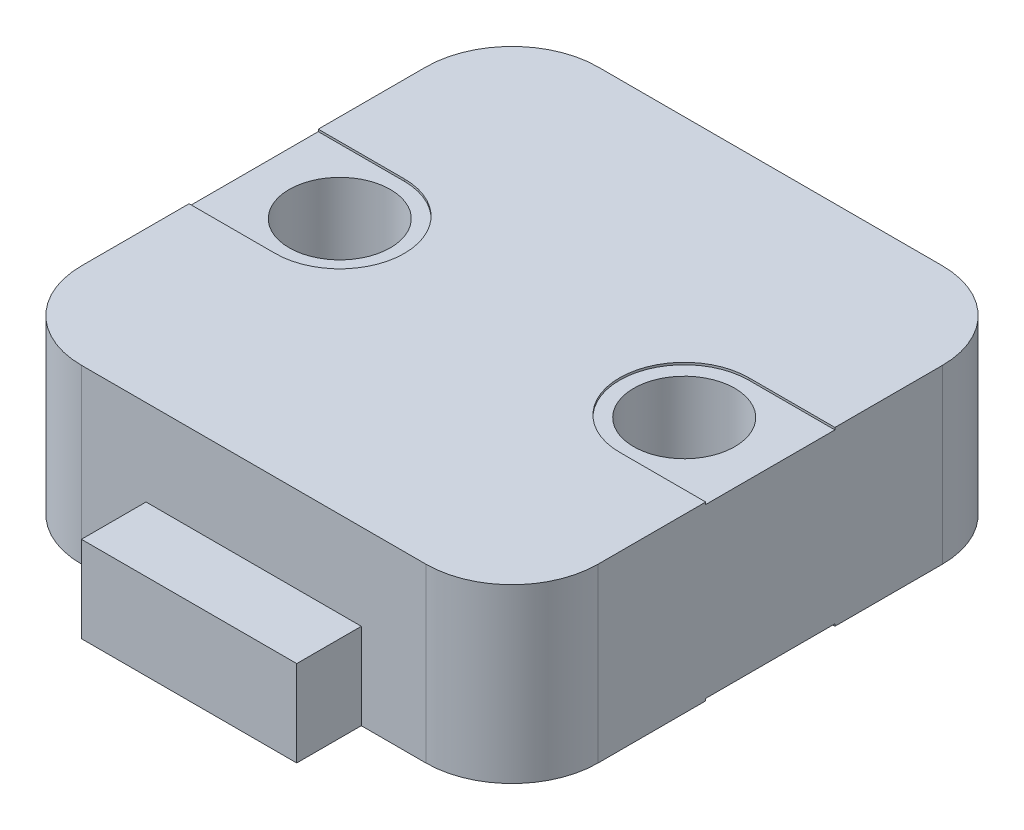
ISO-10303-21;
HEADER;
FILE_DESCRIPTION(('STEP AP214'),'2;1');
FILE_NAME('part.step','',(''),(''),'','','');
FILE_SCHEMA(('AUTOMOTIVE_DESIGN { 1 0 10303 214 1 1 1 1 }'));
ENDSEC;
DATA;
#1=APPLICATION_CONTEXT('core data for automotive mechanical design processes');
#2=APPLICATION_PROTOCOL_DEFINITION('international standard','automotive_design',2000,#1);
#3=PRODUCT_CONTEXT('',#1,'mechanical');
#4=PRODUCT('Part','Part','',(#3));
#5=PRODUCT_RELATED_PRODUCT_CATEGORY('part','',(#4));
#6=PRODUCT_DEFINITION_FORMATION('','',#4);
#7=PRODUCT_DEFINITION_CONTEXT('part definition',#1,'design');
#8=PRODUCT_DEFINITION('design','',#6,#7);
#9=PRODUCT_DEFINITION_SHAPE('','',#8);
#10=(LENGTH_UNIT() NAMED_UNIT(*) SI_UNIT(.MILLI.,.METRE.));
#11=(NAMED_UNIT(*) PLANE_ANGLE_UNIT() SI_UNIT($,.RADIAN.));
#12=(NAMED_UNIT(*) SI_UNIT($,.STERADIAN.) SOLID_ANGLE_UNIT());
#13=UNCERTAINTY_MEASURE_WITH_UNIT(LENGTH_MEASURE(1.E-05),#10,'distance_accuracy_value','');
#14=(GEOMETRIC_REPRESENTATION_CONTEXT(3) GLOBAL_UNCERTAINTY_ASSIGNED_CONTEXT((#13)) GLOBAL_UNIT_ASSIGNED_CONTEXT((#10,
#11,#12)) REPRESENTATION_CONTEXT('',''));
#15=CARTESIAN_POINT('',(0.,0.,0.));
#16=DIRECTION('',(0.,0.,1.));
#17=DIRECTION('',(1.,0.,0.));
#18=AXIS2_PLACEMENT_3D('',#15,#16,#17);
#19=CARTESIAN_POINT('',(-8.,4.,0.));
#20=DIRECTION('',(0.,-1.,0.));
#21=DIRECTION('',(0.,0.,-1.));
#22=AXIS2_PLACEMENT_3D('',#19,#20,#21);
#23=CYLINDRICAL_SURFACE('',#22,2.35);
#24=CARTESIAN_POINT('',(-8.,3.9,0.));
#25=DIRECTION('',(0.,1.,0.));
#26=DIRECTION('',(0.,0.,1.));
#27=AXIS2_PLACEMENT_3D('',#24,#25,#26);
#28=CIRCLE('',#27,2.35);
#29=CARTESIAN_POINT('',(-8.,3.9,2.35));
#30=VERTEX_POINT('',#29);
#31=EDGE_CURVE('E315',#30,#30,#28,.T.);
#32=ORIENTED_EDGE('',*,*,#31,.T.);
#33=EDGE_LOOP('',(#32));
#34=FACE_BOUND('',#33,.T.);
#35=CARTESIAN_POINT('',(-8.,-3.9,0.));
#36=DIRECTION('',(0.,-1.,0.));
#37=DIRECTION('',(0.,0.,-1.));
#38=AXIS2_PLACEMENT_3D('',#35,#36,#37);
#39=CIRCLE('',#38,2.35);
#40=CARTESIAN_POINT('',(-8.,-3.9,-2.35));
#41=VERTEX_POINT('',#40);
#42=EDGE_CURVE('E270',#41,#41,#39,.T.);
#43=ORIENTED_EDGE('',*,*,#42,.T.);
#44=EDGE_LOOP('',(#43));
#45=FACE_BOUND('',#44,.T.);
#46=ADVANCED_FACE('F33',(#34,#45),#23,.F.);
#47=CARTESIAN_POINT('',(-7.99999999999998,-4.,7.99999999999998));
#48=DIRECTION('',(0.,1.,0.));
#49=DIRECTION('',(0.,0.,1.));
#50=AXIS2_PLACEMENT_3D('',#47,#48,#49);
#51=PLANE('',#50);
#52=DIRECTION('',(-1.,0.,0.));
#53=VECTOR('',#52,1.);
#54=CARTESIAN_POINT('',(8.,-4.,-3.));
#55=LINE('',#54,#53);
#56=CARTESIAN_POINT('',(12.,-4.,-3.));
#57=VERTEX_POINT('',#56);
#58=CARTESIAN_POINT('',(8.,-4.,-3.));
#59=VERTEX_POINT('',#58);
#60=EDGE_CURVE('E237',#57,#59,#55,.T.);
#61=ORIENTED_EDGE('',*,*,#60,.T.);
#62=CARTESIAN_POINT('',(8.,-4.,0.));
#63=DIRECTION('',(0.,1.,0.));
#64=DIRECTION('',(0.,0.,-1.));
#65=AXIS2_PLACEMENT_3D('',#62,#63,#64);
#66=CIRCLE('',#65,3.);
#67=CARTESIAN_POINT('',(8.,-4.,3.));
#68=VERTEX_POINT('',#67);
#69=EDGE_CURVE('E240',#59,#68,#66,.T.);
#70=ORIENTED_EDGE('',*,*,#69,.T.);
#71=DIRECTION('',(1.,0.,0.));
#72=VECTOR('',#71,1.);
#73=CARTESIAN_POINT('',(16.5303796260076,-4.,3.));
#74=LINE('',#73,#72);
#75=CARTESIAN_POINT('',(12.,-4.,3.));
#76=VERTEX_POINT('',#75);
#77=EDGE_CURVE('E231',#68,#76,#74,.T.);
#78=ORIENTED_EDGE('',*,*,#77,.T.);
#79=DIRECTION('',(0.,0.,-1.));
#80=VECTOR('',#79,1.);
#81=CARTESIAN_POINT('',(12.,-4.,-8.00000000000001));
#82=LINE('',#81,#80);
#83=CARTESIAN_POINT('',(12.,-4.,7.99999999999995));
#84=VERTEX_POINT('',#83);
#85=EDGE_CURVE('E370',#84,#76,#82,.T.);
#86=ORIENTED_EDGE('',*,*,#85,.F.);
#87=CARTESIAN_POINT('',(8.00000000000002,-4.,7.99999999999998));
#88=DIRECTION('',(0.,1.,0.));
#89=DIRECTION('',(0.,0.,1.));
#90=AXIS2_PLACEMENT_3D('',#87,#88,#89);
#91=CIRCLE('',#90,4.);
#92=CARTESIAN_POINT('',(7.99999999999999,-4.,12.));
#93=VERTEX_POINT('',#92);
#94=EDGE_CURVE('E367',#93,#84,#91,.T.);
#95=ORIENTED_EDGE('',*,*,#94,.F.);
#96=DIRECTION('',(1.,0.,0.));
#97=VECTOR('',#96,1.);
#98=CARTESIAN_POINT('',(-7.99999999999995,-4.,12.));
#99=LINE('',#98,#97);
#100=CARTESIAN_POINT('',(5.,-4.,12.));
#101=VERTEX_POINT('',#100);
#102=EDGE_CURVE('E364',#101,#93,#99,.T.);
#103=ORIENTED_EDGE('',*,*,#102,.F.);
#104=DIRECTION('',(0.,0.,-1.));
#105=VECTOR('',#104,1.);
#106=CARTESIAN_POINT('',(5.,-4.,7.99999999999998));
#107=LINE('',#106,#105);
#108=CARTESIAN_POINT('',(5.,-4.,15.));
#109=VERTEX_POINT('',#108);
#110=EDGE_CURVE('E322',#109,#101,#107,.T.);
#111=ORIENTED_EDGE('',*,*,#110,.F.);
#112=DIRECTION('',(1.,0.,0.));
#113=VECTOR('',#112,1.);
#114=CARTESIAN_POINT('',(-7.99999999999998,-4.,15.));
#115=LINE('',#114,#113);
#116=CARTESIAN_POINT('',(-5.,-4.,15.));
#117=VERTEX_POINT('',#116);
#118=EDGE_CURVE('E329',#117,#109,#115,.T.);
#119=ORIENTED_EDGE('',*,*,#118,.F.);
#120=DIRECTION('',(0.,0.,1.));
#121=VECTOR('',#120,1.);
#122=CARTESIAN_POINT('',(-5.,-4.,7.99999999999998));
#123=LINE('',#122,#121);
#124=CARTESIAN_POINT('',(-5.,-4.,12.));
#125=VERTEX_POINT('',#124);
#126=EDGE_CURVE('E318',#125,#117,#123,.T.);
#127=ORIENTED_EDGE('',*,*,#126,.F.);
#128=CARTESIAN_POINT('',(-7.99999999999995,-4.,12.));
#129=VERTEX_POINT('',#128);
#130=EDGE_CURVE('E365',#129,#125,#99,.T.);
#131=ORIENTED_EDGE('',*,*,#130,.F.);
#132=CARTESIAN_POINT('',(-7.99999999999998,-4.,7.99999999999998));
#133=DIRECTION('',(0.,1.,0.));
#134=DIRECTION('',(0.,0.,1.));
#135=AXIS2_PLACEMENT_3D('',#132,#133,#134);
#136=CIRCLE('',#135,4.);
#137=CARTESIAN_POINT('',(-12.,-4.,7.99999999999995));
#138=VERTEX_POINT('',#137);
#139=EDGE_CURVE('E338',#138,#129,#136,.T.);
#140=ORIENTED_EDGE('',*,*,#139,.F.);
#141=DIRECTION('',(0.,0.,1.));
#142=VECTOR('',#141,1.);
#143=CARTESIAN_POINT('',(-12.,-4.,-8.00000000000001));
#144=LINE('',#143,#142);
#145=CARTESIAN_POINT('',(-12.,-4.,3.));
#146=VERTEX_POINT('',#145);
#147=EDGE_CURVE('E379',#146,#138,#144,.T.);
#148=ORIENTED_EDGE('',*,*,#147,.F.);
#149=DIRECTION('',(1.,0.,0.));
#150=VECTOR('',#149,1.);
#151=CARTESIAN_POINT('',(-16.5303796260076,-4.,3.));
#152=LINE('',#151,#150);
#153=CARTESIAN_POINT('',(-8.,-4.,3.));
#154=VERTEX_POINT('',#153);
#155=EDGE_CURVE('E261',#146,#154,#152,.T.);
#156=ORIENTED_EDGE('',*,*,#155,.T.);
#157=CARTESIAN_POINT('',(-8.,-4.,0.));
#158=DIRECTION('',(0.,1.,0.));
#159=DIRECTION('',(0.,0.,1.));
#160=AXIS2_PLACEMENT_3D('',#157,#158,#159);
#161=CIRCLE('',#160,3.);
#162=CARTESIAN_POINT('',(-8.,-4.,-3.));
#163=VERTEX_POINT('',#162);
#164=EDGE_CURVE('E258',#154,#163,#161,.T.);
#165=ORIENTED_EDGE('',*,*,#164,.T.);
#166=DIRECTION('',(-1.,0.,0.));
#167=VECTOR('',#166,1.);
#168=CARTESIAN_POINT('',(-8.,-4.,-3.));
#169=LINE('',#168,#167);
#170=CARTESIAN_POINT('',(-12.,-4.,-3.));
#171=VERTEX_POINT('',#170);
#172=EDGE_CURVE('E252',#163,#171,#169,.T.);
#173=ORIENTED_EDGE('',*,*,#172,.T.);
#174=CARTESIAN_POINT('',(-12.,-4.,-8.00000000000001));
#175=VERTEX_POINT('',#174);
#176=EDGE_CURVE('E343',#175,#171,#144,.T.);
#177=ORIENTED_EDGE('',*,*,#176,.F.);
#178=CARTESIAN_POINT('',(-7.99999999999998,-4.,-8.00000000000004));
#179=DIRECTION('',(0.,1.,0.));
#180=DIRECTION('',(0.,0.,1.));
#181=AXIS2_PLACEMENT_3D('',#178,#179,#180);
#182=CIRCLE('',#181,4.);
#183=CARTESIAN_POINT('',(-7.99999999999995,-4.,-12.));
#184=VERTEX_POINT('',#183);
#185=EDGE_CURVE('E377',#184,#175,#182,.T.);
#186=ORIENTED_EDGE('',*,*,#185,.F.);
#187=DIRECTION('',(-1.,0.,0.));
#188=VECTOR('',#187,1.);
#189=CARTESIAN_POINT('',(-7.99999999999995,-4.,-12.));
#190=LINE('',#189,#188);
#191=CARTESIAN_POINT('',(7.99999999999999,-4.,-12.));
#192=VERTEX_POINT('',#191);
#193=EDGE_CURVE('E375',#192,#184,#190,.T.);
#194=ORIENTED_EDGE('',*,*,#193,.F.);
#195=CARTESIAN_POINT('',(8.00000000000002,-4.,-8.00000000000004));
#196=DIRECTION('',(0.,1.,0.));
#197=DIRECTION('',(0.,0.,-1.));
#198=AXIS2_PLACEMENT_3D('',#195,#196,#197);
#199=CIRCLE('',#198,4.);
#200=CARTESIAN_POINT('',(12.,-4.,-8.00000000000001));
#201=VERTEX_POINT('',#200);
#202=EDGE_CURVE('E373',#201,#192,#199,.T.);
#203=ORIENTED_EDGE('',*,*,#202,.F.);
#204=EDGE_CURVE('E369',#57,#201,#82,.T.);
#205=ORIENTED_EDGE('',*,*,#204,.F.);
#206=EDGE_LOOP('',(#61,#70,#78,#86,#95,#103,#111,#119,#127,#131,#140,#148,#156,#165,#173,#177,
#186,#194,#203,#205));
#207=FACE_BOUND('',#206,.T.);
#208=ADVANCED_FACE('F439',(#207),#51,.F.);
#209=CARTESIAN_POINT('',(12.,4.,-8.00000000000001));
#210=DIRECTION('',(-1.,0.,0.));
#211=DIRECTION('',(0.,0.,1.));
#212=AXIS2_PLACEMENT_3D('',#209,#210,#211);
#213=PLANE('',#212);
#214=DIRECTION('',(0.,1.,0.));
#215=VECTOR('',#214,1.);
#216=CARTESIAN_POINT('',(12.,4.,-3.));
#217=LINE('',#216,#215);
#218=CARTESIAN_POINT('',(12.,-3.9,-3.));
#219=VERTEX_POINT('',#218);
#220=EDGE_CURVE('E11',#57,#219,#217,.T.);
#221=ORIENTED_EDGE('',*,*,#220,.F.);
#222=ORIENTED_EDGE('',*,*,#204,.T.);
#223=DIRECTION('',(0.,-1.,0.));
#224=VECTOR('',#223,1.);
#225=CARTESIAN_POINT('',(12.,4.,-8.00000000000001));
#226=LINE('',#225,#224);
#227=CARTESIAN_POINT('',(12.,4.,-8.00000000000001));
#228=VERTEX_POINT('',#227);
#229=EDGE_CURVE('E393',#228,#201,#226,.T.);
#230=ORIENTED_EDGE('',*,*,#229,.F.);
#231=DIRECTION('',(0.,0.,-1.));
#232=VECTOR('',#231,1.);
#233=CARTESIAN_POINT('',(12.,4.,-8.00000000000001));
#234=LINE('',#233,#232);
#235=CARTESIAN_POINT('',(12.,4.,-3.));
#236=VERTEX_POINT('',#235);
#237=EDGE_CURVE('E347',#236,#228,#234,.T.);
#238=ORIENTED_EDGE('',*,*,#237,.F.);
#239=DIRECTION('',(0.,-1.,0.));
#240=VECTOR('',#239,1.);
#241=CARTESIAN_POINT('',(12.,4.,-3.));
#242=LINE('',#241,#240);
#243=CARTESIAN_POINT('',(12.,3.9,-3.));
#244=VERTEX_POINT('',#243);
#245=EDGE_CURVE('E423',#236,#244,#242,.T.);
#246=ORIENTED_EDGE('',*,*,#245,.T.);
#247=DIRECTION('',(0.,0.,1.));
#248=VECTOR('',#247,1.);
#249=CARTESIAN_POINT('',(12.,3.9,-8.00000000000001));
#250=LINE('',#249,#248);
#251=CARTESIAN_POINT('',(12.,3.9,3.));
#252=VERTEX_POINT('',#251);
#253=EDGE_CURVE('E312',#244,#252,#250,.T.);
#254=ORIENTED_EDGE('',*,*,#253,.T.);
#255=DIRECTION('',(0.,1.,0.));
#256=VECTOR('',#255,1.);
#257=CARTESIAN_POINT('',(12.,4.,3.));
#258=LINE('',#257,#256);
#259=CARTESIAN_POINT('',(12.,4.,3.));
#260=VERTEX_POINT('',#259);
#261=EDGE_CURVE('E426',#252,#260,#258,.T.);
#262=ORIENTED_EDGE('',*,*,#261,.T.);
#263=CARTESIAN_POINT('',(12.,4.,7.99999999999995));
#264=VERTEX_POINT('',#263);
#265=EDGE_CURVE('E348',#264,#260,#234,.T.);
#266=ORIENTED_EDGE('',*,*,#265,.F.);
#267=DIRECTION('',(0.,-1.,0.));
#268=VECTOR('',#267,1.);
#269=CARTESIAN_POINT('',(12.,4.,7.99999999999995));
#270=LINE('',#269,#268);
#271=EDGE_CURVE('E396',#264,#84,#270,.T.);
#272=ORIENTED_EDGE('',*,*,#271,.T.);
#273=ORIENTED_EDGE('',*,*,#85,.T.);
#274=DIRECTION('',(0.,-1.,0.));
#275=VECTOR('',#274,1.);
#276=CARTESIAN_POINT('',(12.,4.,3.));
#277=LINE('',#276,#275);
#278=CARTESIAN_POINT('',(12.,-3.9,3.));
#279=VERTEX_POINT('',#278);
#280=EDGE_CURVE('E41',#279,#76,#277,.T.);
#281=ORIENTED_EDGE('',*,*,#280,.F.);
#282=DIRECTION('',(0.,0.,-1.));
#283=VECTOR('',#282,1.);
#284=CARTESIAN_POINT('',(12.,-3.9,-8.00000000000001));
#285=LINE('',#284,#283);
#286=EDGE_CURVE('E236',#279,#219,#285,.T.);
#287=ORIENTED_EDGE('',*,*,#286,.T.);
#288=EDGE_LOOP('',(#221,#222,#230,#238,#246,#254,#262,#266,#272,#273,#281,#287));
#289=FACE_BOUND('',#288,.T.);
#290=ADVANCED_FACE('F442',(#289),#213,.F.);
#291=CARTESIAN_POINT('',(-12.,4.,-8.00000000000001));
#292=DIRECTION('',(1.,0.,0.));
#293=DIRECTION('',(0.,0.,-1.));
#294=AXIS2_PLACEMENT_3D('',#291,#292,#293);
#295=PLANE('',#294);
#296=DIRECTION('',(0.,-1.,0.));
#297=VECTOR('',#296,1.);
#298=CARTESIAN_POINT('',(-12.,4.,-3.));
#299=LINE('',#298,#297);
#300=CARTESIAN_POINT('',(-12.,-3.9,-3.));
#301=VERTEX_POINT('',#300);
#302=EDGE_CURVE('E435',#301,#171,#299,.T.);
#303=ORIENTED_EDGE('',*,*,#302,.F.);
#304=DIRECTION('',(0.,0.,-1.));
#305=VECTOR('',#304,1.);
#306=CARTESIAN_POINT('',(-12.,-3.9,-8.00000000000001));
#307=LINE('',#306,#305);
#308=CARTESIAN_POINT('',(-12.,-3.9,3.));
#309=VERTEX_POINT('',#308);
#310=EDGE_CURVE('E429',#309,#301,#307,.T.);
#311=ORIENTED_EDGE('',*,*,#310,.F.);
#312=DIRECTION('',(0.,1.,0.));
#313=VECTOR('',#312,1.);
#314=CARTESIAN_POINT('',(-12.,4.,3.));
#315=LINE('',#314,#313);
#316=EDGE_CURVE('E433',#146,#309,#315,.T.);
#317=ORIENTED_EDGE('',*,*,#316,.F.);
#318=ORIENTED_EDGE('',*,*,#147,.T.);
#319=DIRECTION('',(0.,-1.,0.));
#320=VECTOR('',#319,1.);
#321=CARTESIAN_POINT('',(-12.,4.,7.99999999999995));
#322=LINE('',#321,#320);
#323=CARTESIAN_POINT('',(-12.,4.,7.99999999999995));
#324=VERTEX_POINT('',#323);
#325=EDGE_CURVE('E361',#324,#138,#322,.T.);
#326=ORIENTED_EDGE('',*,*,#325,.F.);
#327=DIRECTION('',(0.,0.,1.));
#328=VECTOR('',#327,1.);
#329=CARTESIAN_POINT('',(-12.,4.,-8.00000000000001));
#330=LINE('',#329,#328);
#331=CARTESIAN_POINT('',(-12.,4.,3.));
#332=VERTEX_POINT('',#331);
#333=EDGE_CURVE('E357',#332,#324,#330,.T.);
#334=ORIENTED_EDGE('',*,*,#333,.F.);
#335=DIRECTION('',(0.,-1.,0.));
#336=VECTOR('',#335,1.);
#337=CARTESIAN_POINT('',(-12.,4.,3.));
#338=LINE('',#337,#336);
#339=CARTESIAN_POINT('',(-12.,3.9,3.));
#340=VERTEX_POINT('',#339);
#341=EDGE_CURVE('E420',#332,#340,#338,.T.);
#342=ORIENTED_EDGE('',*,*,#341,.T.);
#343=DIRECTION('',(0.,0.,1.));
#344=VECTOR('',#343,1.);
#345=CARTESIAN_POINT('',(-12.,3.9,-8.00000000000001));
#346=LINE('',#345,#344);
#347=CARTESIAN_POINT('',(-12.,3.9,-3.));
#348=VERTEX_POINT('',#347);
#349=EDGE_CURVE('E316',#348,#340,#346,.T.);
#350=ORIENTED_EDGE('',*,*,#349,.F.);
#351=DIRECTION('',(0.,1.,0.));
#352=VECTOR('',#351,1.);
#353=CARTESIAN_POINT('',(-12.,4.,-3.));
#354=LINE('',#353,#352);
#355=CARTESIAN_POINT('',(-12.,4.,-3.));
#356=VERTEX_POINT('',#355);
#357=EDGE_CURVE('E413',#348,#356,#354,.T.);
#358=ORIENTED_EDGE('',*,*,#357,.T.);
#359=CARTESIAN_POINT('',(-12.,4.,-8.00000000000001));
#360=VERTEX_POINT('',#359);
#361=EDGE_CURVE('E358',#360,#356,#330,.T.);
#362=ORIENTED_EDGE('',*,*,#361,.F.);
#363=DIRECTION('',(0.,-1.,0.));
#364=VECTOR('',#363,1.);
#365=CARTESIAN_POINT('',(-12.,4.,-8.00000000000001));
#366=LINE('',#365,#364);
#367=EDGE_CURVE('E384',#360,#175,#366,.T.);
#368=ORIENTED_EDGE('',*,*,#367,.T.);
#369=ORIENTED_EDGE('',*,*,#176,.T.);
#370=EDGE_LOOP('',(#303,#311,#317,#318,#326,#334,#342,#350,#358,#362,#368,#369));
#371=FACE_BOUND('',#370,.T.);
#372=ADVANCED_FACE('F496',(#371),#295,.F.);
#373=CARTESIAN_POINT('',(-7.99999999999995,4.,12.));
#374=DIRECTION('',(0.,0.,-1.));
#375=DIRECTION('',(-1.,0.,0.));
#376=AXIS2_PLACEMENT_3D('',#373,#374,#375);
#377=PLANE('',#376);
#378=DIRECTION('',(0.,-1.,0.));
#379=VECTOR('',#378,1.);
#380=CARTESIAN_POINT('',(-5.,4.,12.));
#381=LINE('',#380,#379);
#382=CARTESIAN_POINT('',(-5.,0.,12.));
#383=VERTEX_POINT('',#382);
#384=EDGE_CURVE('E410',#383,#125,#381,.T.);
#385=ORIENTED_EDGE('',*,*,#384,.F.);
#386=DIRECTION('',(1.,0.,0.));
#387=VECTOR('',#386,1.);
#388=CARTESIAN_POINT('',(-7.99999999999995,0.,12.));
#389=LINE('',#388,#387);
#390=CARTESIAN_POINT('',(5.,0.,12.));
#391=VERTEX_POINT('',#390);
#392=EDGE_CURVE('E405',#383,#391,#389,.T.);
#393=ORIENTED_EDGE('',*,*,#392,.T.);
#394=DIRECTION('',(0.,1.,0.));
#395=VECTOR('',#394,1.);
#396=CARTESIAN_POINT('',(5.,4.,12.));
#397=LINE('',#396,#395);
#398=EDGE_CURVE('E407',#101,#391,#397,.T.);
#399=ORIENTED_EDGE('',*,*,#398,.F.);
#400=ORIENTED_EDGE('',*,*,#102,.T.);
#401=DIRECTION('',(0.,-1.,0.));
#402=VECTOR('',#401,1.);
#403=CARTESIAN_POINT('',(7.99999999999999,4.,12.));
#404=LINE('',#403,#402);
#405=CARTESIAN_POINT('',(7.99999999999999,4.,12.));
#406=VERTEX_POINT('',#405);
#407=EDGE_CURVE('E399',#406,#93,#404,.T.);
#408=ORIENTED_EDGE('',*,*,#407,.F.);
#409=DIRECTION('',(1.,0.,0.));
#410=VECTOR('',#409,1.);
#411=CARTESIAN_POINT('',(-7.99999999999995,4.,12.));
#412=LINE('',#411,#410);
#413=CARTESIAN_POINT('',(-7.99999999999995,4.,12.));
#414=VERTEX_POINT('',#413);
#415=EDGE_CURVE('E342',#414,#406,#412,.T.);
#416=ORIENTED_EDGE('',*,*,#415,.F.);
#417=DIRECTION('',(0.,-1.,0.));
#418=VECTOR('',#417,1.);
#419=CARTESIAN_POINT('',(-7.99999999999995,4.,12.));
#420=LINE('',#419,#418);
#421=EDGE_CURVE('E402',#414,#129,#420,.T.);
#422=ORIENTED_EDGE('',*,*,#421,.T.);
#423=ORIENTED_EDGE('',*,*,#130,.T.);
#424=EDGE_LOOP('',(#385,#393,#399,#400,#408,#416,#422,#423));
#425=FACE_BOUND('',#424,.T.);
#426=ADVANCED_FACE('F453',(#425),#377,.F.);
#427=CARTESIAN_POINT('',(-7.99999999999998,4.,7.99999999999998));
#428=DIRECTION('',(0.,1.,0.));
#429=DIRECTION('',(0.,0.,1.));
#430=AXIS2_PLACEMENT_3D('',#427,#428,#429);
#431=PLANE('',#430);
#432=DIRECTION('',(1.,0.,0.));
#433=VECTOR('',#432,1.);
#434=CARTESIAN_POINT('',(16.5303796260076,4.,3.));
#435=LINE('',#434,#433);
#436=CARTESIAN_POINT('',(8.,4.,3.));
#437=VERTEX_POINT('',#436);
#438=EDGE_CURVE('E277',#437,#260,#435,.T.);
#439=ORIENTED_EDGE('',*,*,#438,.F.);
#440=CARTESIAN_POINT('',(8.,4.,0.));
#441=DIRECTION('',(0.,1.,0.));
#442=DIRECTION('',(0.,0.,-1.));
#443=AXIS2_PLACEMENT_3D('',#440,#441,#442);
#444=CIRCLE('',#443,3.);
#445=CARTESIAN_POINT('',(8.,4.,-3.));
#446=VERTEX_POINT('',#445);
#447=EDGE_CURVE('E285',#446,#437,#444,.T.);
#448=ORIENTED_EDGE('',*,*,#447,.F.);
#449=DIRECTION('',(-1.,0.,0.));
#450=VECTOR('',#449,1.);
#451=CARTESIAN_POINT('',(8.,4.,-3.));
#452=LINE('',#451,#450);
#453=EDGE_CURVE('E283',#236,#446,#452,.T.);
#454=ORIENTED_EDGE('',*,*,#453,.F.);
#455=ORIENTED_EDGE('',*,*,#237,.T.);
#456=CARTESIAN_POINT('',(8.00000000000002,4.,-8.00000000000004));
#457=DIRECTION('',(0.,1.,0.));
#458=DIRECTION('',(0.,0.,-1.));
#459=AXIS2_PLACEMENT_3D('',#456,#457,#458);
#460=CIRCLE('',#459,4.);
#461=CARTESIAN_POINT('',(7.99999999999999,4.,-12.));
#462=VERTEX_POINT('',#461);
#463=EDGE_CURVE('E351',#228,#462,#460,.T.);
#464=ORIENTED_EDGE('',*,*,#463,.T.);
#465=DIRECTION('',(-1.,0.,0.));
#466=VECTOR('',#465,1.);
#467=CARTESIAN_POINT('',(-7.99999999999995,4.,-12.));
#468=LINE('',#467,#466);
#469=CARTESIAN_POINT('',(-7.99999999999995,4.,-12.));
#470=VERTEX_POINT('',#469);
#471=EDGE_CURVE('E353',#462,#470,#468,.T.);
#472=ORIENTED_EDGE('',*,*,#471,.T.);
#473=CARTESIAN_POINT('',(-7.99999999999998,4.,-8.00000000000004));
#474=DIRECTION('',(0.,1.,0.));
#475=DIRECTION('',(0.,0.,1.));
#476=AXIS2_PLACEMENT_3D('',#473,#474,#475);
#477=CIRCLE('',#476,4.);
#478=EDGE_CURVE('E355',#470,#360,#477,.T.);
#479=ORIENTED_EDGE('',*,*,#478,.T.);
#480=ORIENTED_EDGE('',*,*,#361,.T.);
#481=DIRECTION('',(-1.,0.,0.));
#482=VECTOR('',#481,1.);
#483=CARTESIAN_POINT('',(-8.,4.,-3.));
#484=LINE('',#483,#482);
#485=CARTESIAN_POINT('',(-8.,4.,-3.));
#486=VERTEX_POINT('',#485);
#487=EDGE_CURVE('E306',#486,#356,#484,.T.);
#488=ORIENTED_EDGE('',*,*,#487,.F.);
#489=CARTESIAN_POINT('',(-8.,4.,0.));
#490=DIRECTION('',(0.,1.,0.));
#491=DIRECTION('',(0.,0.,1.));
#492=AXIS2_PLACEMENT_3D('',#489,#490,#491);
#493=CIRCLE('',#492,3.);
#494=CARTESIAN_POINT('',(-8.,4.,3.));
#495=VERTEX_POINT('',#494);
#496=EDGE_CURVE('E273',#495,#486,#493,.T.);
#497=ORIENTED_EDGE('',*,*,#496,.F.);
#498=DIRECTION('',(1.,0.,0.));
#499=VECTOR('',#498,1.);
#500=CARTESIAN_POINT('',(-16.5303796260076,4.,3.));
#501=LINE('',#500,#499);
#502=EDGE_CURVE('E299',#332,#495,#501,.T.);
#503=ORIENTED_EDGE('',*,*,#502,.F.);
#504=ORIENTED_EDGE('',*,*,#333,.T.);
#505=CARTESIAN_POINT('',(-7.99999999999998,4.,7.99999999999998));
#506=DIRECTION('',(0.,1.,0.));
#507=DIRECTION('',(0.,0.,1.));
#508=AXIS2_PLACEMENT_3D('',#505,#506,#507);
#509=CIRCLE('',#508,4.);
#510=EDGE_CURVE('E339',#324,#414,#509,.T.);
#511=ORIENTED_EDGE('',*,*,#510,.T.);
#512=ORIENTED_EDGE('',*,*,#415,.T.);
#513=CARTESIAN_POINT('',(8.00000000000002,4.,7.99999999999998));
#514=DIRECTION('',(0.,1.,0.));
#515=DIRECTION('',(0.,0.,1.));
#516=AXIS2_PLACEMENT_3D('',#513,#514,#515);
#517=CIRCLE('',#516,4.);
#518=EDGE_CURVE('E345',#406,#264,#517,.T.);
#519=ORIENTED_EDGE('',*,*,#518,.T.);
#520=ORIENTED_EDGE('',*,*,#265,.T.);
#521=EDGE_LOOP('',(#439,#448,#454,#455,#464,#472,#479,#480,#488,#497,#503,#504,#511,#512,#519,#520));
#522=FACE_BOUND('',#521,.T.);
#523=ADVANCED_FACE('F492',(#522),#431,.T.);
#524=CARTESIAN_POINT('',(-7.99999999999998,4.,7.99999999999998));
#525=DIRECTION('',(0.,-1.,0.));
#526=DIRECTION('',(0.,0.,-1.));
#527=AXIS2_PLACEMENT_3D('',#524,#525,#526);
#528=CYLINDRICAL_SURFACE('',#527,4.);
#529=ORIENTED_EDGE('',*,*,#139,.T.);
#530=ORIENTED_EDGE('',*,*,#421,.F.);
#531=ORIENTED_EDGE('',*,*,#510,.F.);
#532=ORIENTED_EDGE('',*,*,#325,.T.);
#533=EDGE_LOOP('',(#529,#530,#531,#532));
#534=FACE_BOUND('',#533,.T.);
#535=ADVANCED_FACE('F35',(#534),#528,.T.);
#536=CARTESIAN_POINT('',(8.00000000000002,4.,7.99999999999998));
#537=DIRECTION('',(0.,-1.,0.));
#538=DIRECTION('',(0.,0.,-1.));
#539=AXIS2_PLACEMENT_3D('',#536,#537,#538);
#540=CYLINDRICAL_SURFACE('',#539,4.);
#541=ORIENTED_EDGE('',*,*,#94,.T.);
#542=ORIENTED_EDGE('',*,*,#271,.F.);
#543=ORIENTED_EDGE('',*,*,#518,.F.);
#544=ORIENTED_EDGE('',*,*,#407,.T.);
#545=EDGE_LOOP('',(#541,#542,#543,#544));
#546=FACE_BOUND('',#545,.T.);
#547=ADVANCED_FACE('F447',(#546),#540,.T.);
#548=CARTESIAN_POINT('',(8.00000000000002,4.,-8.00000000000004));
#549=DIRECTION('',(0.,-1.,0.));
#550=DIRECTION('',(0.,0.,-1.));
#551=AXIS2_PLACEMENT_3D('',#548,#549,#550);
#552=CYLINDRICAL_SURFACE('',#551,4.);
#553=ORIENTED_EDGE('',*,*,#202,.T.);
#554=DIRECTION('',(0.,-1.,0.));
#555=VECTOR('',#554,1.);
#556=CARTESIAN_POINT('',(7.99999999999999,4.,-12.));
#557=LINE('',#556,#555);
#558=EDGE_CURVE('E390',#462,#192,#557,.T.);
#559=ORIENTED_EDGE('',*,*,#558,.F.);
#560=ORIENTED_EDGE('',*,*,#463,.F.);
#561=ORIENTED_EDGE('',*,*,#229,.T.);
#562=EDGE_LOOP('',(#553,#559,#560,#561));
#563=FACE_BOUND('',#562,.T.);
#564=ADVANCED_FACE('F507',(#563),#552,.T.);
#565=CARTESIAN_POINT('',(-7.99999999999995,4.,-12.));
#566=DIRECTION('',(0.,0.,1.));
#567=DIRECTION('',(1.,0.,0.));
#568=AXIS2_PLACEMENT_3D('',#565,#566,#567);
#569=PLANE('',#568);
#570=ORIENTED_EDGE('',*,*,#193,.T.);
#571=DIRECTION('',(0.,-1.,0.));
#572=VECTOR('',#571,1.);
#573=CARTESIAN_POINT('',(-7.99999999999995,4.,-12.));
#574=LINE('',#573,#572);
#575=EDGE_CURVE('E387',#470,#184,#574,.T.);
#576=ORIENTED_EDGE('',*,*,#575,.F.);
#577=ORIENTED_EDGE('',*,*,#471,.F.);
#578=ORIENTED_EDGE('',*,*,#558,.T.);
#579=EDGE_LOOP('',(#570,#576,#577,#578));
#580=FACE_BOUND('',#579,.T.);
#581=ADVANCED_FACE('F503',(#580),#569,.F.);
#582=CARTESIAN_POINT('',(-7.99999999999998,4.,-8.00000000000004));
#583=DIRECTION('',(0.,-1.,0.));
#584=DIRECTION('',(0.,0.,-1.));
#585=AXIS2_PLACEMENT_3D('',#582,#583,#584);
#586=CYLINDRICAL_SURFACE('',#585,4.);
#587=ORIENTED_EDGE('',*,*,#185,.T.);
#588=ORIENTED_EDGE('',*,*,#367,.F.);
#589=ORIENTED_EDGE('',*,*,#478,.F.);
#590=ORIENTED_EDGE('',*,*,#575,.T.);
#591=EDGE_LOOP('',(#587,#588,#589,#590));
#592=FACE_BOUND('',#591,.T.);
#593=ADVANCED_FACE('F500',(#592),#586,.T.);
#594=CARTESIAN_POINT('',(8.,4.,0.));
#595=DIRECTION('',(0.,-1.,0.));
#596=DIRECTION('',(0.,0.,-1.));
#597=AXIS2_PLACEMENT_3D('',#594,#595,#596);
#598=CYLINDRICAL_SURFACE('',#597,2.35);
#599=CARTESIAN_POINT('',(8.,-3.9,0.));
#600=DIRECTION('',(0.,1.,0.));
#601=DIRECTION('',(0.,0.,1.));
#602=AXIS2_PLACEMENT_3D('',#599,#600,#601);
#603=CIRCLE('',#602,2.35);
#604=CARTESIAN_POINT('',(8.,-3.9,2.35));
#605=VERTEX_POINT('',#604);
#606=EDGE_CURVE('E247',#605,#605,#603,.T.);
#607=ORIENTED_EDGE('',*,*,#606,.F.);
#608=EDGE_LOOP('',(#607));
#609=FACE_BOUND('',#608,.T.);
#610=CARTESIAN_POINT('',(8.,3.9,0.));
#611=DIRECTION('',(0.,-1.,0.));
#612=DIRECTION('',(0.,0.,-1.));
#613=AXIS2_PLACEMENT_3D('',#610,#611,#612);
#614=CIRCLE('',#613,2.35);
#615=CARTESIAN_POINT('',(8.,3.9,-2.35));
#616=VERTEX_POINT('',#615);
#617=EDGE_CURVE('E292',#616,#616,#614,.T.);
#618=ORIENTED_EDGE('',*,*,#617,.F.);
#619=EDGE_LOOP('',(#618));
#620=FACE_BOUND('',#619,.T.);
#621=ADVANCED_FACE('F490',(#609,#620),#598,.F.);
#622=CARTESIAN_POINT('',(-5.,0.,7.99999999999998));
#623=DIRECTION('',(1.,0.,0.));
#624=DIRECTION('',(0.,0.,-1.));
#625=AXIS2_PLACEMENT_3D('',#622,#623,#624);
#626=PLANE('',#625);
#627=DIRECTION('',(0.,0.,1.));
#628=VECTOR('',#627,1.);
#629=CARTESIAN_POINT('',(-5.,0.,7.99999999999998));
#630=LINE('',#629,#628);
#631=CARTESIAN_POINT('',(-5.,0.,15.));
#632=VERTEX_POINT('',#631);
#633=EDGE_CURVE('E319',#383,#632,#630,.T.);
#634=ORIENTED_EDGE('',*,*,#633,.F.);
#635=ORIENTED_EDGE('',*,*,#384,.T.);
#636=ORIENTED_EDGE('',*,*,#126,.T.);
#637=DIRECTION('',(0.,-1.,0.));
#638=VECTOR('',#637,1.);
#639=CARTESIAN_POINT('',(-5.,0.,15.));
#640=LINE('',#639,#638);
#641=EDGE_CURVE('E335',#632,#117,#640,.T.);
#642=ORIENTED_EDGE('',*,*,#641,.F.);
#643=EDGE_LOOP('',(#634,#635,#636,#642));
#644=FACE_BOUND('',#643,.T.);
#645=ADVANCED_FACE('F467',(#644),#626,.F.);
#646=CARTESIAN_POINT('',(5.,0.,7.99999999999998));
#647=DIRECTION('',(-1.,0.,0.));
#648=DIRECTION('',(0.,0.,1.));
#649=AXIS2_PLACEMENT_3D('',#646,#647,#648);
#650=PLANE('',#649);
#651=ORIENTED_EDGE('',*,*,#110,.T.);
#652=ORIENTED_EDGE('',*,*,#398,.T.);
#653=DIRECTION('',(0.,0.,-1.));
#654=VECTOR('',#653,1.);
#655=CARTESIAN_POINT('',(5.,0.,7.99999999999998));
#656=LINE('',#655,#654);
#657=CARTESIAN_POINT('',(5.,0.,15.));
#658=VERTEX_POINT('',#657);
#659=EDGE_CURVE('E324',#658,#391,#656,.T.);
#660=ORIENTED_EDGE('',*,*,#659,.F.);
#661=DIRECTION('',(0.,-1.,0.));
#662=VECTOR('',#661,1.);
#663=CARTESIAN_POINT('',(5.,0.,15.));
#664=LINE('',#663,#662);
#665=EDGE_CURVE('E327',#658,#109,#664,.T.);
#666=ORIENTED_EDGE('',*,*,#665,.T.);
#667=EDGE_LOOP('',(#651,#652,#660,#666));
#668=FACE_BOUND('',#667,.T.);
#669=ADVANCED_FACE('F457',(#668),#650,.F.);
#670=CARTESIAN_POINT('',(0.,0.,0.));
#671=DIRECTION('',(0.,1.,0.));
#672=DIRECTION('',(0.,0.,1.));
#673=AXIS2_PLACEMENT_3D('',#670,#671,#672);
#674=PLANE('',#673);
#675=ORIENTED_EDGE('',*,*,#392,.F.);
#676=ORIENTED_EDGE('',*,*,#633,.T.);
#677=DIRECTION('',(1.,0.,0.));
#678=VECTOR('',#677,1.);
#679=CARTESIAN_POINT('',(-7.99999999999998,0.,15.));
#680=LINE('',#679,#678);
#681=EDGE_CURVE('E321',#632,#658,#680,.T.);
#682=ORIENTED_EDGE('',*,*,#681,.T.);
#683=ORIENTED_EDGE('',*,*,#659,.T.);
#684=EDGE_LOOP('',(#675,#676,#682,#683));
#685=FACE_BOUND('',#684,.T.);
#686=ADVANCED_FACE('F469',(#685),#674,.T.);
#687=CARTESIAN_POINT('',(-7.99999999999998,0.,15.));
#688=DIRECTION('',(0.,0.,-1.));
#689=DIRECTION('',(-1.,0.,0.));
#690=AXIS2_PLACEMENT_3D('',#687,#688,#689);
#691=PLANE('',#690);
#692=ORIENTED_EDGE('',*,*,#118,.T.);
#693=ORIENTED_EDGE('',*,*,#665,.F.);
#694=ORIENTED_EDGE('',*,*,#681,.F.);
#695=ORIENTED_EDGE('',*,*,#641,.T.);
#696=EDGE_LOOP('',(#692,#693,#694,#695));
#697=FACE_BOUND('',#696,.T.);
#698=ADVANCED_FACE('F461',(#697),#691,.F.);
#699=CARTESIAN_POINT('',(16.5303796260076,3.9,3.));
#700=DIRECTION('',(0.,0.,1.));
#701=DIRECTION('',(1.,0.,0.));
#702=AXIS2_PLACEMENT_3D('',#699,#700,#701);
#703=PLANE('',#702);
#704=DIRECTION('',(1.,0.,0.));
#705=VECTOR('',#704,1.);
#706=CARTESIAN_POINT('',(16.5303796260076,3.9,3.));
#707=LINE('',#706,#705);
#708=CARTESIAN_POINT('',(8.,3.9,3.));
#709=VERTEX_POINT('',#708);
#710=EDGE_CURVE('E280',#709,#252,#707,.T.);
#711=ORIENTED_EDGE('',*,*,#710,.F.);
#712=DIRECTION('',(0.,1.,0.));
#713=VECTOR('',#712,1.);
#714=CARTESIAN_POINT('',(8.,3.9,3.));
#715=LINE('',#714,#713);
#716=EDGE_CURVE('E290',#709,#437,#715,.T.);
#717=ORIENTED_EDGE('',*,*,#716,.T.);
#718=ORIENTED_EDGE('',*,*,#438,.T.);
#719=ORIENTED_EDGE('',*,*,#261,.F.);
#720=EDGE_LOOP('',(#711,#717,#718,#719));
#721=FACE_BOUND('',#720,.T.);
#722=ADVANCED_FACE('F476',(#721),#703,.F.);
#723=CARTESIAN_POINT('',(8.,3.9,-3.));
#724=DIRECTION('',(0.,0.,-1.));
#725=DIRECTION('',(-1.,0.,0.));
#726=AXIS2_PLACEMENT_3D('',#723,#724,#725);
#727=PLANE('',#726);
#728=ORIENTED_EDGE('',*,*,#453,.T.);
#729=DIRECTION('',(0.,1.,0.));
#730=VECTOR('',#729,1.);
#731=CARTESIAN_POINT('',(8.,3.9,-3.));
#732=LINE('',#731,#730);
#733=CARTESIAN_POINT('',(8.,3.9,-3.));
#734=VERTEX_POINT('',#733);
#735=EDGE_CURVE('E282',#734,#446,#732,.T.);
#736=ORIENTED_EDGE('',*,*,#735,.F.);
#737=DIRECTION('',(-1.,0.,0.));
#738=VECTOR('',#737,1.);
#739=CARTESIAN_POINT('',(8.,3.9,-3.));
#740=LINE('',#739,#738);
#741=EDGE_CURVE('E274',#244,#734,#740,.T.);
#742=ORIENTED_EDGE('',*,*,#741,.F.);
#743=ORIENTED_EDGE('',*,*,#245,.F.);
#744=EDGE_LOOP('',(#728,#736,#742,#743));
#745=FACE_BOUND('',#744,.T.);
#746=ADVANCED_FACE('F581',(#745),#727,.F.);
#747=CARTESIAN_POINT('',(8.,3.9,0.));
#748=DIRECTION('',(0.,-1.,0.));
#749=DIRECTION('',(0.,0.,-1.));
#750=AXIS2_PLACEMENT_3D('',#747,#748,#749);
#751=PLANE('',#750);
#752=ORIENTED_EDGE('',*,*,#617,.T.);
#753=EDGE_LOOP('',(#752));
#754=FACE_BOUND('',#753,.T.);
#755=ORIENTED_EDGE('',*,*,#741,.T.);
#756=CARTESIAN_POINT('',(8.,3.9,0.));
#757=DIRECTION('',(0.,1.,0.));
#758=DIRECTION('',(0.,0.,-1.));
#759=AXIS2_PLACEMENT_3D('',#756,#757,#758);
#760=CIRCLE('',#759,3.);
#761=EDGE_CURVE('E276',#734,#709,#760,.T.);
#762=ORIENTED_EDGE('',*,*,#761,.T.);
#763=ORIENTED_EDGE('',*,*,#710,.T.);
#764=ORIENTED_EDGE('',*,*,#253,.F.);
#765=EDGE_LOOP('',(#755,#762,#763,#764));
#766=FACE_BOUND('',#765,.T.);
#767=ADVANCED_FACE('F588',(#754,#766),#751,.F.);
#768=CARTESIAN_POINT('',(8.,3.9,0.));
#769=DIRECTION('',(0.,1.,0.));
#770=DIRECTION('',(0.,0.,1.));
#771=AXIS2_PLACEMENT_3D('',#768,#769,#770);
#772=CYLINDRICAL_SURFACE('',#771,3.);
#773=ORIENTED_EDGE('',*,*,#447,.T.);
#774=ORIENTED_EDGE('',*,*,#716,.F.);
#775=ORIENTED_EDGE('',*,*,#761,.F.);
#776=ORIENTED_EDGE('',*,*,#735,.T.);
#777=EDGE_LOOP('',(#773,#774,#775,#776));
#778=FACE_BOUND('',#777,.T.);
#779=ADVANCED_FACE('F596',(#778),#772,.F.);
#780=CARTESIAN_POINT('',(-16.5303796260076,3.9,3.));
#781=DIRECTION('',(0.,0.,1.));
#782=DIRECTION('',(1.,0.,0.));
#783=AXIS2_PLACEMENT_3D('',#780,#781,#782);
#784=PLANE('',#783);
#785=ORIENTED_EDGE('',*,*,#502,.T.);
#786=DIRECTION('',(0.,1.,0.));
#787=VECTOR('',#786,1.);
#788=CARTESIAN_POINT('',(-8.,3.9,3.));
#789=LINE('',#788,#787);
#790=CARTESIAN_POINT('',(-8.,3.9,3.));
#791=VERTEX_POINT('',#790);
#792=EDGE_CURVE('E286',#791,#495,#789,.T.);
#793=ORIENTED_EDGE('',*,*,#792,.F.);
#794=DIRECTION('',(1.,0.,0.));
#795=VECTOR('',#794,1.);
#796=CARTESIAN_POINT('',(-16.5303796260076,3.9,3.));
#797=LINE('',#796,#795);
#798=EDGE_CURVE('E301',#340,#791,#797,.T.);
#799=ORIENTED_EDGE('',*,*,#798,.F.);
#800=ORIENTED_EDGE('',*,*,#341,.F.);
#801=EDGE_LOOP('',(#785,#793,#799,#800));
#802=FACE_BOUND('',#801,.T.);
#803=ADVANCED_FACE('F604',(#802),#784,.F.);
#804=CARTESIAN_POINT('',(-8.,3.9,-3.));
#805=DIRECTION('',(0.,0.,-1.));
#806=DIRECTION('',(-1.,0.,0.));
#807=AXIS2_PLACEMENT_3D('',#804,#805,#806);
#808=PLANE('',#807);
#809=DIRECTION('',(-1.,0.,0.));
#810=VECTOR('',#809,1.);
#811=CARTESIAN_POINT('',(-8.,3.9,-3.));
#812=LINE('',#811,#810);
#813=CARTESIAN_POINT('',(-8.,3.9,-3.));
#814=VERTEX_POINT('',#813);
#815=EDGE_CURVE('E298',#814,#348,#812,.T.);
#816=ORIENTED_EDGE('',*,*,#815,.F.);
#817=DIRECTION('',(0.,1.,0.));
#818=VECTOR('',#817,1.);
#819=CARTESIAN_POINT('',(-8.,3.9,-3.));
#820=LINE('',#819,#818);
#821=EDGE_CURVE('E303',#814,#486,#820,.T.);
#822=ORIENTED_EDGE('',*,*,#821,.T.);
#823=ORIENTED_EDGE('',*,*,#487,.T.);
#824=ORIENTED_EDGE('',*,*,#357,.F.);
#825=EDGE_LOOP('',(#816,#822,#823,#824));
#826=FACE_BOUND('',#825,.T.);
#827=ADVANCED_FACE('F612',(#826),#808,.F.);
#828=CARTESIAN_POINT('',(-8.,3.9,0.));
#829=DIRECTION('',(0.,1.,0.));
#830=DIRECTION('',(0.,0.,1.));
#831=AXIS2_PLACEMENT_3D('',#828,#829,#830);
#832=PLANE('',#831);
#833=ORIENTED_EDGE('',*,*,#31,.F.);
#834=EDGE_LOOP('',(#833));
#835=FACE_BOUND('',#834,.T.);
#836=ORIENTED_EDGE('',*,*,#349,.T.);
#837=ORIENTED_EDGE('',*,*,#798,.T.);
#838=CARTESIAN_POINT('',(-8.,3.9,0.));
#839=DIRECTION('',(0.,1.,0.));
#840=DIRECTION('',(0.,0.,1.));
#841=AXIS2_PLACEMENT_3D('',#838,#839,#840);
#842=CIRCLE('',#841,3.);
#843=EDGE_CURVE('E295',#791,#814,#842,.T.);
#844=ORIENTED_EDGE('',*,*,#843,.T.);
#845=ORIENTED_EDGE('',*,*,#815,.T.);
#846=EDGE_LOOP('',(#836,#837,#844,#845));
#847=FACE_BOUND('',#846,.T.);
#848=ADVANCED_FACE('F620',(#835,#847),#832,.T.);
#849=CARTESIAN_POINT('',(-8.,3.9,0.));
#850=DIRECTION('',(0.,1.,0.));
#851=DIRECTION('',(0.,0.,1.));
#852=AXIS2_PLACEMENT_3D('',#849,#850,#851);
#853=CYLINDRICAL_SURFACE('',#852,3.);
#854=ORIENTED_EDGE('',*,*,#496,.T.);
#855=ORIENTED_EDGE('',*,*,#821,.F.);
#856=ORIENTED_EDGE('',*,*,#843,.F.);
#857=ORIENTED_EDGE('',*,*,#792,.T.);
#858=EDGE_LOOP('',(#854,#855,#856,#857));
#859=FACE_BOUND('',#858,.T.);
#860=ADVANCED_FACE('F628',(#859),#853,.F.);
#861=CARTESIAN_POINT('',(8.,-3.9,-3.));
#862=DIRECTION('',(0.,0.,1.));
#863=DIRECTION('',(1.,0.,0.));
#864=AXIS2_PLACEMENT_3D('',#861,#862,#863);
#865=PLANE('',#864);
#866=ORIENTED_EDGE('',*,*,#220,.T.);
#867=DIRECTION('',(-1.,0.,0.));
#868=VECTOR('',#867,1.);
#869=CARTESIAN_POINT('',(8.,-3.9,-3.));
#870=LINE('',#869,#868);
#871=CARTESIAN_POINT('',(8.,-3.9,-3.));
#872=VERTEX_POINT('',#871);
#873=EDGE_CURVE('E48',#219,#872,#870,.T.);
#874=ORIENTED_EDGE('',*,*,#873,.T.);
#875=DIRECTION('',(0.,-1.,0.));
#876=VECTOR('',#875,1.);
#877=CARTESIAN_POINT('',(8.,-3.9,-3.));
#878=LINE('',#877,#876);
#879=EDGE_CURVE('E222',#872,#59,#878,.T.);
#880=ORIENTED_EDGE('',*,*,#879,.T.);
#881=ORIENTED_EDGE('',*,*,#60,.F.);
#882=EDGE_LOOP('',(#866,#874,#880,#881));
#883=FACE_BOUND('',#882,.T.);
#884=ADVANCED_FACE('F636',(#883),#865,.T.);
#885=CARTESIAN_POINT('',(16.5303796260076,-3.9,3.));
#886=DIRECTION('',(0.,0.,-1.));
#887=DIRECTION('',(-1.,0.,0.));
#888=AXIS2_PLACEMENT_3D('',#885,#886,#887);
#889=PLANE('',#888);
#890=ORIENTED_EDGE('',*,*,#280,.T.);
#891=ORIENTED_EDGE('',*,*,#77,.F.);
#892=DIRECTION('',(0.,-1.,0.));
#893=VECTOR('',#892,1.);
#894=CARTESIAN_POINT('',(8.,-3.9,3.));
#895=LINE('',#894,#893);
#896=CARTESIAN_POINT('',(8.,-3.9,3.));
#897=VERTEX_POINT('',#896);
#898=EDGE_CURVE('E220',#897,#68,#895,.T.);
#899=ORIENTED_EDGE('',*,*,#898,.F.);
#900=DIRECTION('',(1.,0.,0.));
#901=VECTOR('',#900,1.);
#902=CARTESIAN_POINT('',(16.5303796260076,-3.9,3.));
#903=LINE('',#902,#901);
#904=EDGE_CURVE('E224',#897,#279,#903,.T.);
#905=ORIENTED_EDGE('',*,*,#904,.T.);
#906=EDGE_LOOP('',(#890,#891,#899,#905));
#907=FACE_BOUND('',#906,.T.);
#908=ADVANCED_FACE('F228',(#907),#889,.T.);
#909=CARTESIAN_POINT('',(8.,-3.9,0.));
#910=DIRECTION('',(0.,1.,0.));
#911=DIRECTION('',(0.,0.,-1.));
#912=AXIS2_PLACEMENT_3D('',#909,#910,#911);
#913=PLANE('',#912);
#914=ORIENTED_EDGE('',*,*,#606,.T.);
#915=EDGE_LOOP('',(#914));
#916=FACE_BOUND('',#915,.T.);
#917=ORIENTED_EDGE('',*,*,#904,.F.);
#918=CARTESIAN_POINT('',(8.,-3.9,0.));
#919=DIRECTION('',(0.,1.,0.));
#920=DIRECTION('',(0.,0.,-1.));
#921=AXIS2_PLACEMENT_3D('',#918,#919,#920);
#922=CIRCLE('',#921,3.);
#923=EDGE_CURVE('E216',#872,#897,#922,.T.);
#924=ORIENTED_EDGE('',*,*,#923,.F.);
#925=ORIENTED_EDGE('',*,*,#873,.F.);
#926=ORIENTED_EDGE('',*,*,#286,.F.);
#927=EDGE_LOOP('',(#917,#924,#925,#926));
#928=FACE_BOUND('',#927,.T.);
#929=ADVANCED_FACE('F234',(#916,#928),#913,.F.);
#930=CARTESIAN_POINT('',(8.,-3.9,0.));
#931=DIRECTION('',(0.,-1.,0.));
#932=DIRECTION('',(0.,0.,-1.));
#933=AXIS2_PLACEMENT_3D('',#930,#931,#932);
#934=CYLINDRICAL_SURFACE('',#933,3.);
#935=ORIENTED_EDGE('',*,*,#69,.F.);
#936=ORIENTED_EDGE('',*,*,#879,.F.);
#937=ORIENTED_EDGE('',*,*,#923,.T.);
#938=ORIENTED_EDGE('',*,*,#898,.T.);
#939=EDGE_LOOP('',(#935,#936,#937,#938));
#940=FACE_BOUND('',#939,.T.);
#941=ADVANCED_FACE('F219',(#940),#934,.F.);
#942=CARTESIAN_POINT('',(-8.,-3.9,-3.));
#943=DIRECTION('',(0.,0.,1.));
#944=DIRECTION('',(1.,0.,0.));
#945=AXIS2_PLACEMENT_3D('',#942,#943,#944);
#946=PLANE('',#945);
#947=ORIENTED_EDGE('',*,*,#302,.T.);
#948=ORIENTED_EDGE('',*,*,#172,.F.);
#949=DIRECTION('',(0.,-1.,0.));
#950=VECTOR('',#949,1.);
#951=CARTESIAN_POINT('',(-8.,-3.9,-3.));
#952=LINE('',#951,#950);
#953=CARTESIAN_POINT('',(-8.,-3.9,-3.));
#954=VERTEX_POINT('',#953);
#955=EDGE_CURVE('E245',#954,#163,#952,.T.);
#956=ORIENTED_EDGE('',*,*,#955,.F.);
#957=DIRECTION('',(-1.,0.,0.));
#958=VECTOR('',#957,1.);
#959=CARTESIAN_POINT('',(-8.,-3.9,-3.));
#960=LINE('',#959,#958);
#961=EDGE_CURVE('E254',#954,#301,#960,.T.);
#962=ORIENTED_EDGE('',*,*,#961,.T.);
#963=EDGE_LOOP('',(#947,#948,#956,#962));
#964=FACE_BOUND('',#963,.T.);
#965=ADVANCED_FACE('F662',(#964),#946,.T.);
#966=CARTESIAN_POINT('',(-16.5303796260076,-3.9,3.));
#967=DIRECTION('',(0.,0.,-1.));
#968=DIRECTION('',(-1.,0.,0.));
#969=AXIS2_PLACEMENT_3D('',#966,#967,#968);
#970=PLANE('',#969);
#971=ORIENTED_EDGE('',*,*,#316,.T.);
#972=DIRECTION('',(1.,0.,0.));
#973=VECTOR('',#972,1.);
#974=CARTESIAN_POINT('',(-16.5303796260076,-3.9,3.));
#975=LINE('',#974,#973);
#976=CARTESIAN_POINT('',(-8.,-3.9,3.));
#977=VERTEX_POINT('',#976);
#978=EDGE_CURVE('E55',#309,#977,#975,.T.);
#979=ORIENTED_EDGE('',*,*,#978,.T.);
#980=DIRECTION('',(0.,-1.,0.));
#981=VECTOR('',#980,1.);
#982=CARTESIAN_POINT('',(-8.,-3.9,3.));
#983=LINE('',#982,#981);
#984=EDGE_CURVE('E257',#977,#154,#983,.T.);
#985=ORIENTED_EDGE('',*,*,#984,.T.);
#986=ORIENTED_EDGE('',*,*,#155,.F.);
#987=EDGE_LOOP('',(#971,#979,#985,#986));
#988=FACE_BOUND('',#987,.T.);
#989=ADVANCED_FACE('F669',(#988),#970,.T.);
#990=CARTESIAN_POINT('',(-8.,-3.9,0.));
#991=DIRECTION('',(0.,-1.,0.));
#992=DIRECTION('',(0.,0.,1.));
#993=AXIS2_PLACEMENT_3D('',#990,#991,#992);
#994=PLANE('',#993);
#995=ORIENTED_EDGE('',*,*,#42,.F.);
#996=EDGE_LOOP('',(#995));
#997=FACE_BOUND('',#996,.T.);
#998=ORIENTED_EDGE('',*,*,#310,.T.);
#999=ORIENTED_EDGE('',*,*,#961,.F.);
#1000=CARTESIAN_POINT('',(-8.,-3.9,0.));
#1001=DIRECTION('',(0.,1.,0.));
#1002=DIRECTION('',(0.,0.,1.));
#1003=AXIS2_PLACEMENT_3D('',#1000,#1001,#1002);
#1004=CIRCLE('',#1003,3.);
#1005=EDGE_CURVE('E249',#977,#954,#1004,.T.);
#1006=ORIENTED_EDGE('',*,*,#1005,.F.);
#1007=ORIENTED_EDGE('',*,*,#978,.F.);
#1008=EDGE_LOOP('',(#998,#999,#1006,#1007));
#1009=FACE_BOUND('',#1008,.T.);
#1010=ADVANCED_FACE('F677',(#997,#1009),#994,.T.);
#1011=CARTESIAN_POINT('',(-8.,-3.9,0.));
#1012=DIRECTION('',(0.,-1.,0.));
#1013=DIRECTION('',(0.,0.,-1.));
#1014=AXIS2_PLACEMENT_3D('',#1011,#1012,#1013);
#1015=CYLINDRICAL_SURFACE('',#1014,3.);
#1016=ORIENTED_EDGE('',*,*,#164,.F.);
#1017=ORIENTED_EDGE('',*,*,#984,.F.);
#1018=ORIENTED_EDGE('',*,*,#1005,.T.);
#1019=ORIENTED_EDGE('',*,*,#955,.T.);
#1020=EDGE_LOOP('',(#1016,#1017,#1018,#1019));
#1021=FACE_BOUND('',#1020,.T.);
#1022=ADVANCED_FACE('F685',(#1021),#1015,.F.);
#1023=CLOSED_SHELL('',(#46,#208,#290,#372,#426,#523,#535,#547,#564,#581,#593,#621,#645,#669,
#686,#698,#722,#746,#767,#779,#803,#827,#848,#860,#884,#908,#929,#941,#965,#989,#1010,#1022));
#1024=MANIFOLD_SOLID_BREP('B2',#1023);
#1025=ADVANCED_BREP_SHAPE_REPRESENTATION('',(#18,#1024),#14);
#1026=SHAPE_DEFINITION_REPRESENTATION(#9,#1025);
ENDSEC;
END-ISO-10303-21;
